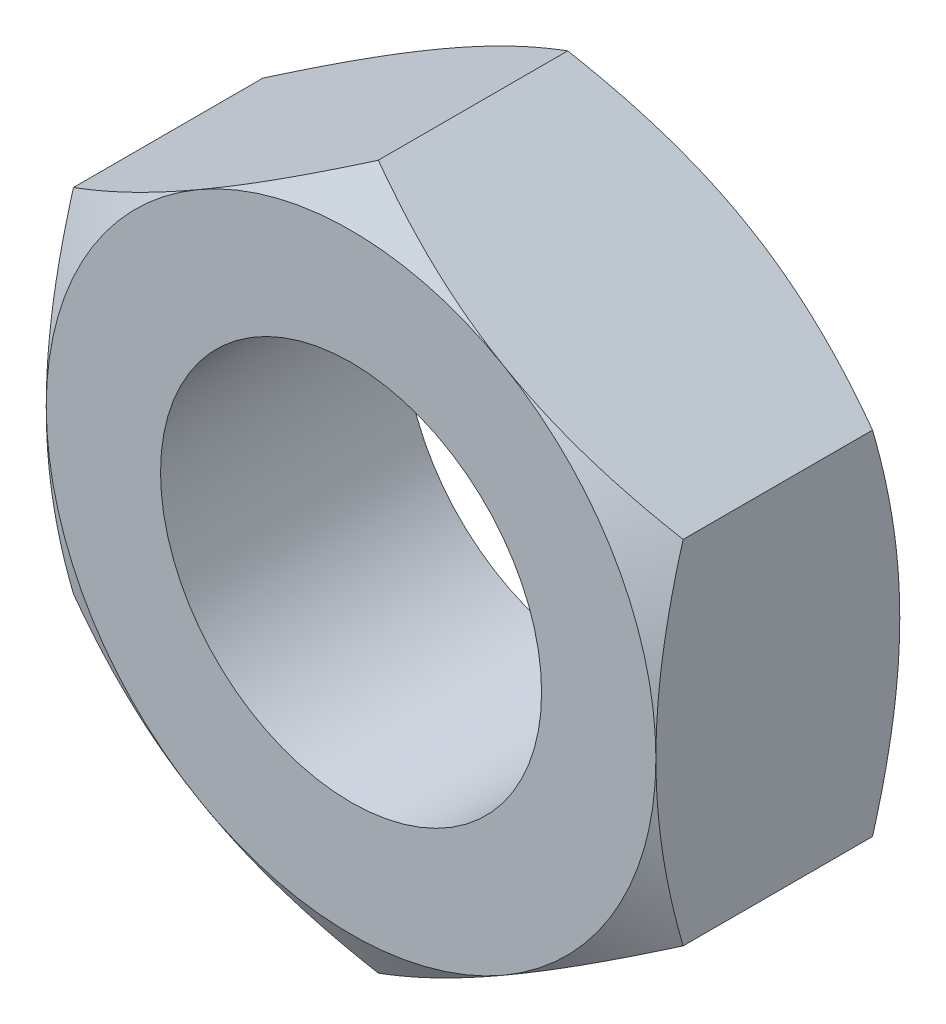
ISO-10303-21;
HEADER;
FILE_DESCRIPTION(('STEP AP214'),'2;1');
FILE_NAME('part.step','',(''),(''),'','','');
FILE_SCHEMA(('AUTOMOTIVE_DESIGN { 1 0 10303 214 1 1 1 1 }'));
ENDSEC;
DATA;
#1=APPLICATION_CONTEXT('core data for automotive mechanical design processes');
#2=APPLICATION_PROTOCOL_DEFINITION('international standard','automotive_design',2000,#1);
#3=PRODUCT_CONTEXT('',#1,'mechanical');
#4=PRODUCT('Part','Part','',(#3));
#5=PRODUCT_RELATED_PRODUCT_CATEGORY('part','',(#4));
#6=PRODUCT_DEFINITION_FORMATION('','',#4);
#7=PRODUCT_DEFINITION_CONTEXT('part definition',#1,'design');
#8=PRODUCT_DEFINITION('design','',#6,#7);
#9=PRODUCT_DEFINITION_SHAPE('','',#8);
#10=(LENGTH_UNIT() NAMED_UNIT(*) SI_UNIT(.MILLI.,.METRE.));
#11=(NAMED_UNIT(*) PLANE_ANGLE_UNIT() SI_UNIT($,.RADIAN.));
#12=(NAMED_UNIT(*) SI_UNIT($,.STERADIAN.) SOLID_ANGLE_UNIT());
#13=UNCERTAINTY_MEASURE_WITH_UNIT(LENGTH_MEASURE(1.E-05),#10,'distance_accuracy_value','');
#14=(GEOMETRIC_REPRESENTATION_CONTEXT(3) GLOBAL_UNCERTAINTY_ASSIGNED_CONTEXT((#13)) GLOBAL_UNIT_ASSIGNED_CONTEXT((#10,
#11,#12)) REPRESENTATION_CONTEXT('',''));
#15=CARTESIAN_POINT('',(0.,0.,0.));
#16=DIRECTION('',(0.,0.,1.));
#17=DIRECTION('',(1.,0.,0.));
#18=AXIS2_PLACEMENT_3D('',#15,#16,#17);
#19=CARTESIAN_POINT('',(3.99999999999999,2.30940107675854,3.19999999999999));
#20=DIRECTION('',(-0.499999999999998,-0.866025403784441,0.));
#21=DIRECTION('',(0.866025403784441,-0.499999999999998,0.));
#22=AXIS2_PLACEMENT_3D('',#19,#20,#21);
#23=PLANE('',#22);
#24=DIRECTION('',(0.,0.,-1.));
#25=VECTOR('',#24,1.);
#26=CARTESIAN_POINT('',(3.99999999999999,2.30940107675854,3.19999999999999));
#27=LINE('',#26,#25);
#28=CARTESIAN_POINT('',(3.99999999999999,2.30940107675855,2.84273441009183));
#29=VERTEX_POINT('',#28);
#30=CARTESIAN_POINT('',(3.99999999999999,2.30940107675854,0.357265589908158));
#31=VERTEX_POINT('',#30);
#32=EDGE_CURVE('E276',#29,#31,#27,.T.);
#33=ORIENTED_EDGE('',*,*,#32,.T.);
#34=CARTESIAN_POINT('',(4.00019999999999,2.30928560670471,0.357332259074762));
#35=CARTESIAN_POINT('',(3.82442084967676,2.41077174646174,0.298717873648283));
#36=CARTESIAN_POINT('',(3.6471243836736,2.51313390883503,0.245410321462265));
#37=CARTESIAN_POINT('',(3.28946140682428,2.71963072479815,0.152361670746409));
#38=CARTESIAN_POINT('',(3.10908854102983,2.82376904741908,0.11265348902971));
#39=CARTESIAN_POINT('',(2.75057818129719,3.03075510011799,0.0508422152802874));
#40=CARTESIAN_POINT('',(2.57249584706484,3.13357098372495,0.0283277315228994));
#41=CARTESIAN_POINT('',(2.21549328283347,3.33968651028532,0.0014506231465906));
#42=CARTESIAN_POINT('',(2.03657435035588,3.44298540411437,-0.00293425857305206));
#43=CARTESIAN_POINT('',(1.70225715780325,3.63600352522935,0.00619007293997645));
#44=CARTESIAN_POINT('',(1.54680884001292,3.72575165335068,0.0174589539880046));
#45=CARTESIAN_POINT('',(1.23692494436493,3.90466320392057,0.0531739907982059));
#46=CARTESIAN_POINT('',(1.08249043825586,3.99382600759481,0.0776323457115441));
#47=CARTESIAN_POINT('',(0.771967672225416,4.17310641015199,0.138776064919299));
#48=CARTESIAN_POINT('',(0.615918711936894,4.26320131938133,0.175720603654873));
#49=CARTESIAN_POINT('',(0.30614816459616,4.44204742827552,0.259570072548033));
#50=CARTESIAN_POINT('',(0.152422609226221,4.53080091904968,0.306455302212743));
#51=CARTESIAN_POINT('',(-0.00019999999999968,4.61891762357086,0.357332259074762));
#52=B_SPLINE_CURVE_WITH_KNOTS('',3,(#34,#35,#36,#37,#38,#39,#40,#41,#42,#43,#44,#45,#46,#47,#48,
#49,#50,#51),.UNSPECIFIED.,.F.,.F.,(4,2,2,2,2,2,2,2,4),(0.,0.634047835695965,1.26961969224543,
1.88946157213122,2.50854226669297,3.04757825393385,3.58711366126902,4.13861653143761,
4.6890364803774),.UNSPECIFIED.);
#53=CARTESIAN_POINT('',(1.99999999999999,3.46410161513776,0.));
#54=VERTEX_POINT('',#53);
#55=EDGE_CURVE('E318',#31,#54,#52,.T.);
#56=ORIENTED_EDGE('',*,*,#55,.T.);
#57=CARTESIAN_POINT('',(0.,4.61880215351702,0.357265589908158));
#58=VERTEX_POINT('',#57);
#59=EDGE_CURVE('E320',#54,#58,#52,.T.);
#60=ORIENTED_EDGE('',*,*,#59,.T.);
#61=DIRECTION('',(0.,0.,-1.));
#62=VECTOR('',#61,1.);
#63=CARTESIAN_POINT('',(0.,4.61880215351702,3.19999999999999));
#64=LINE('',#63,#62);
#65=CARTESIAN_POINT('',(0.,4.61880215351702,2.84273441009183));
#66=VERTEX_POINT('',#65);
#67=EDGE_CURVE('E288',#66,#58,#64,.T.);
#68=ORIENTED_EDGE('',*,*,#67,.F.);
#69=CARTESIAN_POINT('',(-0.000200000000001414,4.61891762357086,2.84266774092523));
#70=CARTESIAN_POINT('',(0.175579150323229,4.51743148381382,2.9012821263517));
#71=CARTESIAN_POINT('',(0.352875616326382,4.41506932144053,2.95458967853772));
#72=CARTESIAN_POINT('',(0.71053859317571,4.20857250547741,3.04763832925358));
#73=CARTESIAN_POINT('',(0.890911458970156,4.10443418285648,3.08734651097028));
#74=CARTESIAN_POINT('',(1.2494218187028,3.89744813015757,3.1491577847197));
#75=CARTESIAN_POINT('',(1.42750415293515,3.79463224655061,3.17167226847709));
#76=CARTESIAN_POINT('',(1.78450671716652,3.58851671999024,3.1985493768534));
#77=CARTESIAN_POINT('',(1.96342564964411,3.48521782616118,3.20293425857305));
#78=CARTESIAN_POINT('',(2.29774284219674,3.29219970504621,3.19380992706002));
#79=CARTESIAN_POINT('',(2.45319115998707,3.20245157692489,3.18254104601199));
#80=CARTESIAN_POINT('',(2.76307505563505,3.02354002635499,3.14682600920178));
#81=CARTESIAN_POINT('',(2.91750956174413,2.93437722268075,3.12236765428845));
#82=CARTESIAN_POINT('',(3.22803232777457,2.75509682012357,3.06122393508069));
#83=CARTESIAN_POINT('',(3.38408128806309,2.66500191089423,3.02427939634512));
#84=CARTESIAN_POINT('',(3.69385183540383,2.48615580200004,2.94042992745196));
#85=CARTESIAN_POINT('',(3.84757739077377,2.39740231122589,2.89354469778725));
#86=CARTESIAN_POINT('',(4.00019999999999,2.30928560670471,2.84266774092523));
#87=B_SPLINE_CURVE_WITH_KNOTS('',3,(#69,#70,#71,#72,#73,#74,#75,#76,#77,#78,#79,#80,#81,#82,#83,
#84,#85,#86),.UNSPECIFIED.,.F.,.F.,(4,2,2,2,2,2,2,2,4),(0.,0.634047835695966,1.26961969224544,
1.88946157213123,2.50854226669298,3.04757825393385,3.58711366126902,4.13861653143762,
4.6890364803774),.UNSPECIFIED.);
#88=CARTESIAN_POINT('',(1.99999999999999,3.46410161513776,3.19999999999999));
#89=VERTEX_POINT('',#88);
#90=EDGE_CURVE('E258',#66,#89,#87,.T.);
#91=ORIENTED_EDGE('',*,*,#90,.T.);
#92=EDGE_CURVE('E240',#89,#29,#87,.T.);
#93=ORIENTED_EDGE('',*,*,#92,.T.);
#94=EDGE_LOOP('',(#33,#56,#60,#68,#91,#93));
#95=FACE_BOUND('',#94,.T.);
#96=ADVANCED_FACE('F39',(#95),#23,.F.);
#97=CARTESIAN_POINT('',(0.,4.61880215351702,3.19999999999999));
#98=DIRECTION('',(0.500000000000003,-0.866025403784439,0.));
#99=DIRECTION('',(0.866025403784438,0.500000000000003,0.));
#100=AXIS2_PLACEMENT_3D('',#97,#98,#99);
#101=PLANE('',#100);
#102=ORIENTED_EDGE('',*,*,#67,.T.);
#103=CARTESIAN_POINT('',(0.000200000000001414,4.61891762357086,0.357332259074762));
#104=CARTESIAN_POINT('',(-0.175579150323226,4.51743148381382,0.298717873648284));
#105=CARTESIAN_POINT('',(-0.352875616326379,4.41506932144053,0.245410321462266));
#106=CARTESIAN_POINT('',(-0.710538593175705,4.2085725054774,0.152361670746408));
#107=CARTESIAN_POINT('',(-0.89091145897015,4.10443418285648,0.112653489029707));
#108=CARTESIAN_POINT('',(-1.24942181870279,3.89744813015757,0.0508422152802819));
#109=CARTESIAN_POINT('',(-1.42750415293514,3.7946322465506,0.0283277315228924));
#110=CARTESIAN_POINT('',(-1.78450671716651,3.58851671999023,0.00145062314658245));
#111=CARTESIAN_POINT('',(-1.9634256496441,3.48521782616117,-0.00293425857305977));
#112=CARTESIAN_POINT('',(-2.29774284219673,3.29219970504619,0.00619007293996701));
#113=CARTESIAN_POINT('',(-2.45319115998707,3.20245157692487,0.0174589539879935));
#114=CARTESIAN_POINT('',(-2.76307505563506,3.02354002635497,0.0531739907981941));
#115=CARTESIAN_POINT('',(-2.91750956174414,2.93437722268072,0.077632345711533));
#116=CARTESIAN_POINT('',(-3.22803232777459,2.75509682012354,0.138776064919289));
#117=CARTESIAN_POINT('',(-3.38408128806311,2.66500191089419,0.175720603654863));
#118=CARTESIAN_POINT('',(-3.69385183540385,2.486155802,0.259570072548026));
#119=CARTESIAN_POINT('',(-3.84757739077379,2.39740231122584,0.306455302212738));
#120=CARTESIAN_POINT('',(-4.00020000000002,2.30928560670466,0.357332259074762));
#121=B_SPLINE_CURVE_WITH_KNOTS('',3,(#103,#104,#105,#106,#107,#108,#109,#110,#111,#112,#113,
#114,#115,#116,#117,#118,#119,#120),.UNSPECIFIED.,.F.,.F.,(4,2,2,2,2,2,2,2,4),(0.,
0.634047835695967,1.26961969224544,1.88946157213123,2.50854226669298,3.04757825393387,
3.58711366126905,4.13861653143765,4.68903648037745),.UNSPECIFIED.);
#122=CARTESIAN_POINT('',(-2.00000000000001,3.46410161513776,0.));
#123=VERTEX_POINT('',#122);
#124=EDGE_CURVE('E161',#58,#123,#121,.T.);
#125=ORIENTED_EDGE('',*,*,#124,.T.);
#126=CARTESIAN_POINT('',(-4.00000000000002,2.3094010767585,0.357265589908158));
#127=VERTEX_POINT('',#126);
#128=EDGE_CURVE('E147',#123,#127,#121,.T.);
#129=ORIENTED_EDGE('',*,*,#128,.T.);
#130=DIRECTION('',(0.,0.,-1.));
#131=VECTOR('',#130,1.);
#132=CARTESIAN_POINT('',(-4.00000000000002,2.3094010767585,3.19999999999999));
#133=LINE('',#132,#131);
#134=CARTESIAN_POINT('',(-4.00000000000002,2.3094010767585,2.84273441009183));
#135=VERTEX_POINT('',#134);
#136=EDGE_CURVE('E160',#135,#127,#133,.T.);
#137=ORIENTED_EDGE('',*,*,#136,.F.);
#138=CARTESIAN_POINT('',(-4.00020000000002,2.30928560670466,2.84266774092523));
#139=CARTESIAN_POINT('',(-3.82442084967679,2.4107717464617,2.90128212635171));
#140=CARTESIAN_POINT('',(-3.64712438367363,2.51313390883499,2.95458967853773));
#141=CARTESIAN_POINT('',(-3.28946140682431,2.71963072479811,3.04763832925358));
#142=CARTESIAN_POINT('',(-3.10908854102986,2.82376904741904,3.08734651097028));
#143=CARTESIAN_POINT('',(-2.75057818129722,3.03075510011795,3.14915778471971));
#144=CARTESIAN_POINT('',(-2.57249584706487,3.13357098372491,3.1716722684771));
#145=CARTESIAN_POINT('',(-2.2154932828335,3.33968651028528,3.19854937685341));
#146=CARTESIAN_POINT('',(-2.03657435035591,3.44298540411434,3.20293425857305));
#147=CARTESIAN_POINT('',(-1.70225715780328,3.63600352522932,3.19380992706003));
#148=CARTESIAN_POINT('',(-1.54680884001295,3.72575165335065,3.182541046012));
#149=CARTESIAN_POINT('',(-1.23692494436495,3.90466320392054,3.14682600920179));
#150=CARTESIAN_POINT('',(-1.08249043825588,3.99382600759479,3.12236765428845));
#151=CARTESIAN_POINT('',(-0.771967672225427,4.17310641015198,3.0612239350807));
#152=CARTESIAN_POINT('',(-0.615918711936902,4.26320131938132,3.02427939634512));
#153=CARTESIAN_POINT('',(-0.306148164596162,4.44204742827551,2.94042992745196));
#154=CARTESIAN_POINT('',(-0.152422609226221,4.53080091904967,2.89354469778725));
#155=CARTESIAN_POINT('',(0.000200000000000547,4.61891762357086,2.84266774092523));
#156=B_SPLINE_CURVE_WITH_KNOTS('',3,(#138,#139,#140,#141,#142,#143,#144,#145,#146,#147,#148,
#149,#150,#151,#152,#153,#154,#155),.UNSPECIFIED.,.F.,.F.,(4,2,2,2,2,2,2,2,4),(0.,
0.634047835695965,1.26961969224543,1.88946157213122,2.50854226669297,3.04757825393386,
3.58711366126904,4.13861653143765,4.68903648037745),.UNSPECIFIED.);
#157=CARTESIAN_POINT('',(-2.00000000000001,3.46410161513776,3.19999999999999));
#158=VERTEX_POINT('',#157);
#159=EDGE_CURVE('E256',#135,#158,#156,.T.);
#160=ORIENTED_EDGE('',*,*,#159,.T.);
#161=EDGE_CURVE('E202',#158,#66,#156,.T.);
#162=ORIENTED_EDGE('',*,*,#161,.T.);
#163=EDGE_LOOP('',(#102,#125,#129,#137,#160,#162));
#164=FACE_BOUND('',#163,.T.);
#165=ADVANCED_FACE('F187',(#164),#101,.F.);
#166=CARTESIAN_POINT('',(-4.00000000000002,2.3094010767585,3.19999999999999));
#167=DIRECTION('',(1.,0.,0.));
#168=DIRECTION('',(0.,1.,0.));
#169=AXIS2_PLACEMENT_3D('',#166,#167,#168);
#170=PLANE('',#169);
#171=ORIENTED_EDGE('',*,*,#136,.T.);
#172=CARTESIAN_POINT('',(-3.99999999999999,-6.20531485108539,1.95306817635055));
#173=CARTESIAN_POINT('',(-3.99999999999999,-6.03059559937679,1.86830570973528));
#174=CARTESIAN_POINT('',(-3.99999999999999,-5.85547548724872,1.78435539020549));
#175=CARTESIAN_POINT('',(-3.99999999999999,-5.50422038479375,1.61853575731478));
#176=CARTESIAN_POINT('',(-3.99999999999999,-5.32808524001501,1.53666677149536));
#177=CARTESIAN_POINT('',(-3.99999999999999,-4.97368033342963,1.37505504782418));
#178=CARTESIAN_POINT('',(-3.99999999999999,-4.79540417208425,1.29532629535012));
#179=CARTESIAN_POINT('',(-3.99999999999999,-4.43743463928703,1.1391287777984));
#180=CARTESIAN_POINT('',(-3.99999999999999,-4.25774133520144,1.06265985885286));
#181=CARTESIAN_POINT('',(-4.,-3.89083616292435,0.911445742892711));
#182=CARTESIAN_POINT('',(-4.,-3.70356846749713,0.836835265740932));
#183=CARTESIAN_POINT('',(-4.,-3.32684283238657,0.693256330654623));
#184=CARTESIAN_POINT('',(-4.,-3.13738464969201,0.624288505701615));
#185=CARTESIAN_POINT('',(-4.,-2.75633068535704,0.493803981419094));
#186=CARTESIAN_POINT('',(-4.,-2.56474011576776,0.432272214115611));
#187=CARTESIAN_POINT('',(-4.,-2.17881058178464,0.318633048569077));
#188=CARTESIAN_POINT('',(-3.99999999999999,-1.98447250332775,0.266522683888706));
#189=CARTESIAN_POINT('',(-4.,-1.59402130057405,0.174504423638667));
#190=CARTESIAN_POINT('',(-4.,-1.39792414052078,0.134530035778608));
#191=CARTESIAN_POINT('',(-4.00000000000001,-1.00328885929075,0.0690401121401172));
#192=CARTESIAN_POINT('',(-4.00000000000001,-0.804750970758018,0.0435232090625291));
#193=CARTESIAN_POINT('',(-4.00000000000001,-0.408819788571312,0.00931767853150848));
#194=CARTESIAN_POINT('',(-4.00000000000001,-0.211445666839738,0.000412601565093382));
#195=CARTESIAN_POINT('',(-4.00000000000001,0.183352945022197,-0.000384123780465341));
#196=CARTESIAN_POINT('',(-4.,0.380777435994328,0.00772453372664156));
#197=CARTESIAN_POINT('',(-4.,0.715890256509153,0.0353550938388946));
#198=CARTESIAN_POINT('',(-4.00000000000001,0.853936847968405,0.0507808323543803));
#199=CARTESIAN_POINT('',(-4.00000000000001,1.1290147152421,0.0889916223152015));
#200=CARTESIAN_POINT('',(-4.00000000000001,1.26604585060678,0.111777673039042));
#201=CARTESIAN_POINT('',(-4.00000000000001,1.6754368247132,0.189978189175679));
#202=CARTESIAN_POINT('',(-4.00000000000001,1.9459400294709,0.255220619350999));
#203=CARTESIAN_POINT('',(-4.00000000000002,2.35040662161547,0.368289136118621));
#204=CARTESIAN_POINT('',(-4.00000000000002,2.48646841753158,0.409035848563481));
#205=CARTESIAN_POINT('',(-4.00000000000002,2.75727018628109,0.494745769578396));
#206=CARTESIAN_POINT('',(-4.00000000000002,2.89201015046039,0.539709005733919));
#207=CARTESIAN_POINT('',(-4.00000000000002,3.16021113460967,0.633131741469656));
#208=CARTESIAN_POINT('',(-4.00000000000002,3.2936725638897,0.681590076661986));
#209=CARTESIAN_POINT('',(-4.00000000000002,3.55949084336818,0.781434487894111));
#210=CARTESIAN_POINT('',(-4.00000000000002,3.6918477058562,0.83282053130991));
#211=CARTESIAN_POINT('',(-4.00000000000002,4.00148018311937,0.956345831773722));
#212=CARTESIAN_POINT('',(-4.00000000000002,4.17835670511997,1.02948355605103));
#213=CARTESIAN_POINT('',(-4.00000000000002,4.53062333479865,1.17926468904874));
#214=CARTESIAN_POINT('',(-4.00000000000002,4.70601335572145,1.25590830073272));
#215=CARTESIAN_POINT('',(-4.00000000000002,5.05557707577674,1.41200457299534));
#216=CARTESIAN_POINT('',(-4.00000000000002,5.22975052860242,1.49145778373291));
#217=CARTESIAN_POINT('',(-4.00000000000002,5.57705164417118,1.65262125473595));
#218=CARTESIAN_POINT('',(-4.00000000000002,5.75017928482936,1.73433156246389));
#219=CARTESIAN_POINT('',(-4.00000000000003,6.2685872261397,1.98235594218953));
#220=CARTESIAN_POINT('',(-4.00000000000003,6.61255544761498,2.15141085262719));
#221=CARTESIAN_POINT('',(-4.00000000000003,7.29800744765992,2.49448270875328));
#222=CARTESIAN_POINT('',(-4.00000000000003,7.63949113521785,2.66849983507696));
#223=CARTESIAN_POINT('',(-4.00000000000003,8.29245240972907,3.00552170059946));
#224=CARTESIAN_POINT('',(-4.00000000000003,8.60407487946716,3.16824626182502));
#225=CARTESIAN_POINT('',(-4.00000000000004,9.22615276047956,3.49593313052514));
#226=CARTESIAN_POINT('',(-4.00000000000004,9.53660813128945,3.66089551468979));
#227=CARTESIAN_POINT('',(-4.00000000000004,10.1558450303186,3.99212251260688));
#228=CARTESIAN_POINT('',(-4.00000000000004,10.4646287956752,4.15838294941037));
#229=CARTESIAN_POINT('',(-4.00000000000004,11.0814482833042,4.49224640286864));
#230=CARTESIAN_POINT('',(-4.00000000000004,11.3894840453237,4.65984934605702));
#231=CARTESIAN_POINT('',(-4.00000000000004,11.697243761791,4.82795398009453));
#232=B_SPLINE_CURVE_WITH_KNOTS('',3,(#172,#173,#174,#175,#176,#177,#178,#179,#180,#181,#182,
#183,#184,#185,#186,#187,#188,#189,#190,#191,#192,#193,#194,#195,#196,#197,#198,#199,#200,#201,
#202,#203,#204,#205,#206,#207,#208,#209,#210,#211,#212,#213,#214,#215,#216,#217,#218,#219,#220,
#221,#222,#223,#224,#225,#226,#227,#228,#229,#230,#231),.UNSPECIFIED.,.F.,.F.,(4,2,2,2,2,2,2,2,
2,2,2,2,2,2,2,2,2,2,2,2,2,2,2,2,2,2,2,2,2,4),(0.,0.582590522715544,1.16527216773886,
1.75112278792907,2.3369457246093,2.941625989466,3.54637399341449,4.14987526068661,
4.75318617643643,5.35312931718923,5.95301570956946,6.54502955530821,7.13705404482698,
7.55356931022439,7.97014114792471,8.8037473346155,9.22980760087719,9.65587065471752,
10.0817924160395,10.5077094321643,11.0818624696283,11.6560487882508,12.2303481700782,
12.8046596375426,13.9543924249202,15.1041671185873,16.1588070157011,17.2134831470422,
18.2655771711968,19.3176140093336),.UNSPECIFIED.);
#233=CARTESIAN_POINT('',(-4.,0.,0.));
#234=VERTEX_POINT('',#233);
#235=EDGE_CURVE('E139',#127,#234,#232,.F.);
#236=ORIENTED_EDGE('',*,*,#235,.T.);
#237=CARTESIAN_POINT('',(-4.,-2.30940107675852,0.357265589908161));
#238=VERTEX_POINT('',#237);
#239=EDGE_CURVE('E128',#234,#238,#232,.F.);
#240=ORIENTED_EDGE('',*,*,#239,.T.);
#241=DIRECTION('',(0.,0.,-1.));
#242=VECTOR('',#241,1.);
#243=CARTESIAN_POINT('',(-4.,-2.30940107675852,3.2));
#244=LINE('',#243,#242);
#245=CARTESIAN_POINT('',(-4.,-2.30940107675852,2.84273441009184));
#246=VERTEX_POINT('',#245);
#247=EDGE_CURVE('E270',#246,#238,#244,.T.);
#248=ORIENTED_EDGE('',*,*,#247,.F.);
#249=CARTESIAN_POINT('',(-3.99999999999999,-6.20531485108539,1.24693182364945));
#250=CARTESIAN_POINT('',(-3.99999999999999,-6.03059559937679,1.33169429026471));
#251=CARTESIAN_POINT('',(-3.99999999999999,-5.85547548724872,1.4156446097945));
#252=CARTESIAN_POINT('',(-3.99999999999999,-5.50422038479375,1.58146424268521));
#253=CARTESIAN_POINT('',(-3.99999999999999,-5.32808524001501,1.66333322850463));
#254=CARTESIAN_POINT('',(-3.99999999999999,-4.97368033342963,1.82494495217581));
#255=CARTESIAN_POINT('',(-3.99999999999999,-4.79540417208425,1.90467370464987));
#256=CARTESIAN_POINT('',(-3.99999999999999,-4.43743463928703,2.06087122220158));
#257=CARTESIAN_POINT('',(-3.99999999999999,-4.25774133520145,2.13734014114713));
#258=CARTESIAN_POINT('',(-4.,-3.89083616292436,2.28855425710728));
#259=CARTESIAN_POINT('',(-4.,-3.70356846749713,2.36316473425906));
#260=CARTESIAN_POINT('',(-4.,-3.32684283238657,2.50674366934537));
#261=CARTESIAN_POINT('',(-4.,-3.13738464969201,2.57571149429837));
#262=CARTESIAN_POINT('',(-4.,-2.75633068535704,2.70619601858089));
#263=CARTESIAN_POINT('',(-4.,-2.56474011576776,2.76772778588438));
#264=CARTESIAN_POINT('',(-4.,-2.17881058178464,2.88136695143091));
#265=CARTESIAN_POINT('',(-4.,-1.98447250332775,2.93347731611129));
#266=CARTESIAN_POINT('',(-4.,-1.59402130057405,3.02549557636133));
#267=CARTESIAN_POINT('',(-4.,-1.39792414052078,3.06546996422138));
#268=CARTESIAN_POINT('',(-4.00000000000001,-1.00328885929075,3.13095988785987));
#269=CARTESIAN_POINT('',(-4.00000000000001,-0.804750970758019,3.15647679093746));
#270=CARTESIAN_POINT('',(-4.00000000000001,-0.408819788571313,3.19068232146848));
#271=CARTESIAN_POINT('',(-4.00000000000001,-0.211445666839739,3.19958739843489));
#272=CARTESIAN_POINT('',(-4.00000000000001,0.183352945022196,3.20038412378046));
#273=CARTESIAN_POINT('',(-4.00000000000001,0.380777435994327,3.19227546627336));
#274=CARTESIAN_POINT('',(-4.00000000000001,0.715890256509151,3.16464490616111));
#275=CARTESIAN_POINT('',(-4.00000000000001,0.853936847968402,3.14921916764561));
#276=CARTESIAN_POINT('',(-4.00000000000001,1.12901471524209,3.11100837768478));
#277=CARTESIAN_POINT('',(-4.00000000000001,1.26604585060677,3.08822232696095));
#278=CARTESIAN_POINT('',(-4.00000000000001,1.6754368247132,3.01002181082431));
#279=CARTESIAN_POINT('',(-4.00000000000001,1.9459400294709,2.94477938064899));
#280=CARTESIAN_POINT('',(-4.00000000000002,2.35040662161546,2.83171086388137));
#281=CARTESIAN_POINT('',(-4.00000000000002,2.48646841753158,2.79096415143651));
#282=CARTESIAN_POINT('',(-4.00000000000002,2.75727018628109,2.70525423042159));
#283=CARTESIAN_POINT('',(-4.00000000000002,2.89201015046039,2.66029099426607));
#284=CARTESIAN_POINT('',(-4.00000000000002,3.16021113460967,2.56686825853033));
#285=CARTESIAN_POINT('',(-4.00000000000002,3.2936725638897,2.518409923338));
#286=CARTESIAN_POINT('',(-4.00000000000002,3.55949084336818,2.41856551210588));
#287=CARTESIAN_POINT('',(-4.00000000000002,3.6918477058562,2.36717946869008));
#288=CARTESIAN_POINT('',(-4.00000000000002,4.00148018311937,2.24365416822627));
#289=CARTESIAN_POINT('',(-4.00000000000002,4.17835670511997,2.17051644394896));
#290=CARTESIAN_POINT('',(-4.00000000000002,4.53062333479865,2.02073531095124));
#291=CARTESIAN_POINT('',(-4.00000000000002,4.70601335572144,1.94409169926727));
#292=CARTESIAN_POINT('',(-4.00000000000002,5.05557707577673,1.78799542700465));
#293=CARTESIAN_POINT('',(-4.00000000000002,5.22975052860242,1.70854221626708));
#294=CARTESIAN_POINT('',(-4.00000000000002,5.57705164417117,1.54737874526404));
#295=CARTESIAN_POINT('',(-4.00000000000002,5.75017928482935,1.4656684375361));
#296=CARTESIAN_POINT('',(-4.00000000000003,6.2685872261397,1.21764405781046));
#297=CARTESIAN_POINT('',(-4.00000000000003,6.61255544761497,1.0485891473728));
#298=CARTESIAN_POINT('',(-4.00000000000003,7.29800744765991,0.705517291246706));
#299=CARTESIAN_POINT('',(-4.00000000000003,7.63949113521784,0.531500164923033));
#300=CARTESIAN_POINT('',(-4.00000000000003,8.29245240972907,0.194478299400528));
#301=CARTESIAN_POINT('',(-4.00000000000003,8.60407487946715,0.0317537381749734));
#302=CARTESIAN_POINT('',(-4.00000000000004,9.22615276047956,-0.295933130525146));
#303=CARTESIAN_POINT('',(-4.00000000000004,9.53660813128945,-0.460895514689804));
#304=CARTESIAN_POINT('',(-4.00000000000004,10.1558450303186,-0.792122512606892));
#305=CARTESIAN_POINT('',(-4.00000000000004,10.4646287956752,-0.958382949410377));
#306=CARTESIAN_POINT('',(-4.00000000000004,11.0814482833042,-1.29224640286865));
#307=CARTESIAN_POINT('',(-4.00000000000004,11.3894840453237,-1.45984934605702));
#308=CARTESIAN_POINT('',(-4.00000000000004,11.697243761791,-1.62795398009453));
#309=B_SPLINE_CURVE_WITH_KNOTS('',3,(#249,#250,#251,#252,#253,#254,#255,#256,#257,#258,#259,
#260,#261,#262,#263,#264,#265,#266,#267,#268,#269,#270,#271,#272,#273,#274,#275,#276,#277,#278,
#279,#280,#281,#282,#283,#284,#285,#286,#287,#288,#289,#290,#291,#292,#293,#294,#295,#296,#297,
#298,#299,#300,#301,#302,#303,#304,#305,#306,#307,#308),.UNSPECIFIED.,.F.,.F.,(4,2,2,2,2,2,2,2,
2,2,2,2,2,2,2,2,2,2,2,2,2,2,2,2,2,2,2,2,2,4),(0.,0.582590522715541,1.16527216773885,
1.75112278792907,2.3369457246093,2.94162598946599,3.54637399341449,4.14987526068661,
4.75318617643642,5.35312931718922,5.95301570956946,6.5450295553082,7.13705404482698,
7.55356931022438,7.9701411479247,8.80374733461549,9.22980760087718,9.65587065471751,
10.0817924160395,10.5077094321643,11.0818624696283,11.6560487882508,12.2303481700782,
12.8046596375426,13.9543924249202,15.1041671185873,16.1588070157011,17.2134831470422,
18.2655771711968,19.3176140093336),.UNSPECIFIED.);
#310=CARTESIAN_POINT('',(-4.00000000000001,0.,3.19999999999999));
#311=VERTEX_POINT('',#310);
#312=EDGE_CURVE('E200',#246,#311,#309,.T.);
#313=ORIENTED_EDGE('',*,*,#312,.T.);
#314=EDGE_CURVE('E193',#311,#135,#309,.T.);
#315=ORIENTED_EDGE('',*,*,#314,.T.);
#316=EDGE_LOOP('',(#171,#236,#240,#248,#313,#315));
#317=FACE_BOUND('',#316,.T.);
#318=ADVANCED_FACE('F157',(#317),#170,.F.);
#319=CARTESIAN_POINT('',(-4.,-2.30940107675852,3.2));
#320=DIRECTION('',(0.499999999999998,0.866025403784441,0.));
#321=DIRECTION('',(-0.866025403784441,0.499999999999998,0.));
#322=AXIS2_PLACEMENT_3D('',#319,#320,#321);
#323=PLANE('',#322);
#324=ORIENTED_EDGE('',*,*,#247,.T.);
#325=CARTESIAN_POINT('',(-4.00019999999999,-2.30928560670467,0.357332259074765));
#326=CARTESIAN_POINT('',(-3.82442084967677,-2.41077174646172,0.298717873648282));
#327=CARTESIAN_POINT('',(-3.64712438367361,-2.51313390883501,0.245410321462263));
#328=CARTESIAN_POINT('',(-3.28946140682429,-2.71963072479813,0.152361670746405));
#329=CARTESIAN_POINT('',(-3.10908854102984,-2.82376904741905,0.112653489029705));
#330=CARTESIAN_POINT('',(-2.7505781812972,-3.03075510011796,0.0508422152802811));
#331=CARTESIAN_POINT('',(-2.57249584706485,-3.13357098372493,0.0283277315228919));
#332=CARTESIAN_POINT('',(-2.21549328283348,-3.33968651028529,0.00145062314658218));
#333=CARTESIAN_POINT('',(-2.03657435035589,-3.44298540411435,-0.00293425857306011));
#334=CARTESIAN_POINT('',(-1.70225715780326,-3.63600352522933,0.0061900729399673));
#335=CARTESIAN_POINT('',(-1.54680884001293,-3.72575165335065,0.0174589539879944));
#336=CARTESIAN_POINT('',(-1.23692494436494,-3.90466320392055,0.0531739907981954));
#337=CARTESIAN_POINT('',(-1.08249043825586,-3.99382600759479,0.0776323457115341));
#338=CARTESIAN_POINT('',(-0.771967672225411,-4.17310641015197,0.138776064919289));
#339=CARTESIAN_POINT('',(-0.615918711936887,-4.26320131938131,0.175720603654863));
#340=CARTESIAN_POINT('',(-0.306148164596148,-4.44204742827551,0.259570072548026));
#341=CARTESIAN_POINT('',(-0.152422609226207,-4.53080091904966,0.306455302212739));
#342=CARTESIAN_POINT('',(0.000200000000015292,-4.61891762357084,0.357332259074765));
#343=B_SPLINE_CURVE_WITH_KNOTS('',3,(#325,#326,#327,#328,#329,#330,#331,#332,#333,#334,#335,
#336,#337,#338,#339,#340,#341,#342),.UNSPECIFIED.,.F.,.F.,(4,2,2,2,2,2,2,2,4),(0.,
0.634047835695965,1.26961969224543,1.88946157213122,2.50854226669297,3.04757825393386,
3.58711366126903,4.13861653143764,4.68903648037743),.UNSPECIFIED.);
#344=CARTESIAN_POINT('',(-1.99999999999999,-3.46410161513776,0.));
#345=VERTEX_POINT('',#344);
#346=EDGE_CURVE('E134',#238,#345,#343,.T.);
#347=ORIENTED_EDGE('',*,*,#346,.T.);
#348=CARTESIAN_POINT('',(0.,-4.61880215351701,0.357265589908161));
#349=VERTEX_POINT('',#348);
#350=EDGE_CURVE('E55',#345,#349,#343,.T.);
#351=ORIENTED_EDGE('',*,*,#350,.T.);
#352=DIRECTION('',(0.,0.,-1.));
#353=VECTOR('',#352,1.);
#354=CARTESIAN_POINT('',(0.,-4.61880215351701,3.2));
#355=LINE('',#354,#353);
#356=CARTESIAN_POINT('',(0.,-4.61880215351701,2.84273441009185));
#357=VERTEX_POINT('',#356);
#358=EDGE_CURVE('E283',#357,#349,#355,.T.);
#359=ORIENTED_EDGE('',*,*,#358,.F.);
#360=CARTESIAN_POINT('',(0.000200000000015292,-4.61891762357085,2.84266774092525));
#361=CARTESIAN_POINT('',(-0.175579150323216,-4.51743148381381,2.90128212635172));
#362=CARTESIAN_POINT('',(-0.352875616326369,-4.41506932144052,2.95458967853773));
#363=CARTESIAN_POINT('',(-0.710538593175695,-4.2085725054774,3.04763832925358));
#364=CARTESIAN_POINT('',(-0.890911458970139,-4.10443418285647,3.08734651097028));
#365=CARTESIAN_POINT('',(-1.24942181870278,-3.89744813015757,3.14915778471971));
#366=CARTESIAN_POINT('',(-1.42750415293513,-3.7946322465506,3.1716722684771));
#367=CARTESIAN_POINT('',(-1.7845067171665,-3.58851671999024,3.19854937685341));
#368=CARTESIAN_POINT('',(-1.96342564964409,-3.48521782616118,3.20293425857306));
#369=CARTESIAN_POINT('',(-2.29774284219672,-3.2921997050462,3.19380992706003));
#370=CARTESIAN_POINT('',(-2.45319115998705,-3.20245157692488,3.182541046012));
#371=CARTESIAN_POINT('',(-2.76307505563504,-3.02354002635498,3.14682600920179));
#372=CARTESIAN_POINT('',(-2.91750956174412,-2.93437722268074,3.12236765428846));
#373=CARTESIAN_POINT('',(-3.22803232777457,-2.75509682012355,3.0612239350807));
#374=CARTESIAN_POINT('',(-3.38408128806309,-2.66500191089422,3.02427939634512));
#375=CARTESIAN_POINT('',(-3.69385183540383,-2.48615580200002,2.94042992745196));
#376=CARTESIAN_POINT('',(-3.84757739077377,-2.39740231122586,2.89354469778726));
#377=CARTESIAN_POINT('',(-4.00019999999999,-2.30928560670467,2.84266774092525));
#378=B_SPLINE_CURVE_WITH_KNOTS('',3,(#360,#361,#362,#363,#364,#365,#366,#367,#368,#369,#370,
#371,#372,#373,#374,#375,#376,#377),.UNSPECIFIED.,.F.,.F.,(4,2,2,2,2,2,2,2,4),(0.,
0.634047835695962,1.26961969224543,1.88946157213122,2.50854226669296,3.04757825393385,
3.58711366126903,4.13861653143763,4.68903648037742),.UNSPECIFIED.);
#379=CARTESIAN_POINT('',(-1.99999999999999,-3.46410161513777,3.2));
#380=VERTEX_POINT('',#379);
#381=EDGE_CURVE('E245',#357,#380,#378,.T.);
#382=ORIENTED_EDGE('',*,*,#381,.T.);
#383=EDGE_CURVE('E201',#380,#246,#378,.T.);
#384=ORIENTED_EDGE('',*,*,#383,.T.);
#385=EDGE_LOOP('',(#324,#347,#351,#359,#382,#384));
#386=FACE_BOUND('',#385,.T.);
#387=ADVANCED_FACE('F186',(#386),#323,.F.);
#388=CARTESIAN_POINT('',(0.,-4.61880215351701,3.2));
#389=DIRECTION('',(-0.500000000000003,0.866025403784438,0.));
#390=DIRECTION('',(-0.866025403784438,-0.500000000000003,0.));
#391=AXIS2_PLACEMENT_3D('',#388,#389,#390);
#392=PLANE('',#391);
#393=ORIENTED_EDGE('',*,*,#358,.T.);
#394=CARTESIAN_POINT('',(-0.000199999999984067,-4.61891762357085,0.357332259074765));
#395=CARTESIAN_POINT('',(0.175579150323245,-4.51743148381381,0.298717873648282));
#396=CARTESIAN_POINT('',(0.352875616326397,-4.41506932144052,0.245410321462263));
#397=CARTESIAN_POINT('',(0.710538593175721,-4.20857250547739,0.152361670746404));
#398=CARTESIAN_POINT('',(0.890911458970165,-4.10443418285647,0.112653489029704));
#399=CARTESIAN_POINT('',(1.2494218187028,-3.89744813015756,0.0508422152802805));
#400=CARTESIAN_POINT('',(1.42750415293516,-3.79463224655059,0.0283277315228917));
#401=CARTESIAN_POINT('',(1.78450671716652,-3.58851671999022,0.00145062314658221));
#402=CARTESIAN_POINT('',(1.96342564964411,-3.48521782616116,-0.00293425857306025));
#403=CARTESIAN_POINT('',(2.29774284219674,-3.29219970504618,0.00619007293996739));
#404=CARTESIAN_POINT('',(2.45319115998708,-3.20245157692486,0.0174589539879947));
#405=CARTESIAN_POINT('',(2.76307505563507,-3.02354002635496,0.0531739907981957));
#406=CARTESIAN_POINT('',(2.91750956174414,-2.93437722268072,0.0776323457115343));
#407=CARTESIAN_POINT('',(3.22803232777459,-2.75509682012353,0.138776064919289));
#408=CARTESIAN_POINT('',(3.38408128806311,-2.66500191089419,0.175720603654864));
#409=CARTESIAN_POINT('',(3.69385183540384,-2.486155802,0.259570072548024));
#410=CARTESIAN_POINT('',(3.84757739077378,-2.39740231122584,0.306455302212735));
#411=CARTESIAN_POINT('',(4.0002,-2.30928560670465,0.357332259074755));
#412=B_SPLINE_CURVE_WITH_KNOTS('',3,(#394,#395,#396,#397,#398,#399,#400,#401,#402,#403,#404,
#405,#406,#407,#408,#409,#410,#411),.UNSPECIFIED.,.F.,.F.,(4,2,2,2,2,2,2,2,4),(0.,
0.634047835695965,1.26961969224543,1.88946157213122,2.50854226669297,3.04757825393385,
3.58711366126903,4.13861653143763,4.68903648037742),.UNSPECIFIED.);
#413=CARTESIAN_POINT('',(2.00000000000002,-3.46410161513775,0.));
#414=VERTEX_POINT('',#413);
#415=EDGE_CURVE('E460',#349,#414,#412,.T.);
#416=ORIENTED_EDGE('',*,*,#415,.T.);
#417=CARTESIAN_POINT('',(4.,-2.30940107675911,0.357265589907734));
#418=VERTEX_POINT('',#417);
#419=EDGE_CURVE('E62',#414,#418,#412,.T.);
#420=ORIENTED_EDGE('',*,*,#419,.T.);
#421=DIRECTION('',(0.,0.,-1.));
#422=VECTOR('',#421,1.);
#423=CARTESIAN_POINT('',(4.,-2.3094010767585,3.19999999999999));
#424=LINE('',#423,#422);
#425=CARTESIAN_POINT('',(4.,-2.3094010767585,2.84273441009184));
#426=VERTEX_POINT('',#425);
#427=EDGE_CURVE('E280',#426,#418,#424,.T.);
#428=ORIENTED_EDGE('',*,*,#427,.F.);
#429=CARTESIAN_POINT('',(4.0002,-2.30928560670465,2.84266774092524));
#430=CARTESIAN_POINT('',(3.82442084967677,-2.4107717464617,2.90128212635171));
#431=CARTESIAN_POINT('',(3.64712438367362,-2.51313390883499,2.95458967853773));
#432=CARTESIAN_POINT('',(3.2894614068243,-2.71963072479811,3.04763832925359));
#433=CARTESIAN_POINT('',(3.10908854102985,-2.82376904741904,3.08734651097029));
#434=CARTESIAN_POINT('',(2.75057818129721,-3.03075510011795,3.14915778471971));
#435=CARTESIAN_POINT('',(2.57249584706486,-3.13357098372492,3.1716722684771));
#436=CARTESIAN_POINT('',(2.2154932828335,-3.33968651028528,3.19854937685341));
#437=CARTESIAN_POINT('',(2.03657435035591,-3.44298540411434,3.20293425857305));
#438=CARTESIAN_POINT('',(1.70225715780328,-3.63600352522932,3.19380992706002));
#439=CARTESIAN_POINT('',(1.54680884001294,-3.72575165335065,3.18254104601199));
#440=CARTESIAN_POINT('',(1.23692494436496,-3.90466320392054,3.14682600920179));
#441=CARTESIAN_POINT('',(1.08249043825588,-3.99382600759478,3.12236765428846));
#442=CARTESIAN_POINT('',(0.771967672225437,-4.17310641015197,3.0612239350807));
#443=CARTESIAN_POINT('',(0.615918711936914,-4.26320131938131,3.02427939634512));
#444=CARTESIAN_POINT('',(0.306148164596178,-4.4420474282755,2.94042992745197));
#445=CARTESIAN_POINT('',(0.152422609226238,-4.53080091904966,2.89354469778726));
#446=CARTESIAN_POINT('',(-0.000199999999984067,-4.61891762357085,2.84266774092525));
#447=B_SPLINE_CURVE_WITH_KNOTS('',3,(#429,#430,#431,#432,#433,#434,#435,#436,#437,#438,#439,
#440,#441,#442,#443,#444,#445,#446),.UNSPECIFIED.,.F.,.F.,(4,2,2,2,2,2,2,2,4),(0.,
0.634047835695963,1.26961969224543,1.88946157213122,2.50854226669296,3.04757825393385,
3.58711366126902,4.13861653143762,4.68903648037741),.UNSPECIFIED.);
#448=CARTESIAN_POINT('',(2.00000000000001,-3.46410161513775,3.19999999999999));
#449=VERTEX_POINT('',#448);
#450=EDGE_CURVE('E233',#426,#449,#447,.T.);
#451=ORIENTED_EDGE('',*,*,#450,.T.);
#452=EDGE_CURVE('E251',#449,#357,#447,.T.);
#453=ORIENTED_EDGE('',*,*,#452,.T.);
#454=EDGE_LOOP('',(#393,#416,#420,#428,#451,#453));
#455=FACE_BOUND('',#454,.T.);
#456=ADVANCED_FACE('F346',(#455),#392,.F.);
#457=CARTESIAN_POINT('',(4.,-2.3094010767585,3.19999999999999));
#458=DIRECTION('',(-1.,0.,0.));
#459=DIRECTION('',(0.,-1.,0.));
#460=AXIS2_PLACEMENT_3D('',#457,#458,#459);
#461=PLANE('',#460);
#462=ORIENTED_EDGE('',*,*,#427,.T.);
#463=CARTESIAN_POINT('',(4.00000000000001,-6.20531485094847,1.95306817628411));
#464=CARTESIAN_POINT('',(4.00000000000001,-6.03059559924447,1.86830570967162));
#465=CARTESIAN_POINT('',(4.00000000000001,-5.855475487121,1.78435539014461));
#466=CARTESIAN_POINT('',(4.00000000000001,-5.50422038467524,1.61853575725944));
#467=CARTESIAN_POINT('',(4.00000000000001,-5.32808523990112,1.53666677144279));
#468=CARTESIAN_POINT('',(4.00000000000001,-4.97368033332504,1.37505504777714));
#469=CARTESIAN_POINT('',(4.00000000000001,-4.79540417198435,1.29532629530585));
#470=CARTESIAN_POINT('',(4.00000000000001,-4.43743463919654,1.13912877775962));
#471=CARTESIAN_POINT('',(4.00000000000001,-4.25774133511568,1.06265985881679));
#472=CARTESIAN_POINT('',(4.,-3.89083616284839,0.911445742862155));
#473=CARTESIAN_POINT('',(4.,-3.70356846742624,0.83683526571316));
#474=CARTESIAN_POINT('',(4.,-3.32684283232591,0.693256330632266));
#475=CARTESIAN_POINT('',(4.,-3.13738464963651,0.62428850568189));
#476=CARTESIAN_POINT('',(4.,-2.75633068531195,0.493803981404379));
#477=CARTESIAN_POINT('',(4.,-2.56474011572793,0.432272214103276));
#478=CARTESIAN_POINT('',(4.,-2.17881058175546,0.318633048561094));
#479=CARTESIAN_POINT('',(4.,-1.98447250330398,0.266522683882694));
#480=CARTESIAN_POINT('',(4.,-1.59402130056389,0.174504423636646));
#481=CARTESIAN_POINT('',(4.,-1.39792414051887,0.134530035778447));
#482=CARTESIAN_POINT('',(4.,-1.00328885930554,0.069040112142409));
#483=CARTESIAN_POINT('',(4.,-0.804750970781251,0.0435232090654147));
#484=CARTESIAN_POINT('',(4.,-0.408819788611291,0.00931767853408561));
#485=CARTESIAN_POINT('',(4.,-0.211445666888016,0.000412601566795399));
#486=CARTESIAN_POINT('',(3.99999999999999,0.183352944957454,-0.000384123781952416));
#487=CARTESIAN_POINT('',(3.99999999999999,0.38077743592142,0.00772453372284002));
#488=CARTESIAN_POINT('',(3.99999999999999,0.715890256425906,0.0353550938304478));
#489=CARTESIAN_POINT('',(3.99999999999999,0.853936847882895,0.0507808323440849));
#490=CARTESIAN_POINT('',(3.99999999999999,1.12901471515216,0.0889916223011062));
#491=CARTESIAN_POINT('',(3.99999999999999,1.26604585051467,0.111777673022996));
#492=CARTESIAN_POINT('',(3.99999999999999,1.67543682461472,0.189978189153737));
#493=CARTESIAN_POINT('',(3.99999999999999,1.94594002936832,0.255220619325073));
#494=CARTESIAN_POINT('',(3.99999999999999,2.35040662150677,0.368289136086812));
#495=CARTESIAN_POINT('',(3.99999999999999,2.4864684174208,0.409035848529698));
#496=CARTESIAN_POINT('',(3.99999999999999,2.75727018616618,0.494745769540723));
#497=CARTESIAN_POINT('',(3.99999999999999,2.89201015034342,0.539709005694331));
#498=CARTESIAN_POINT('',(3.99999999999999,3.1602111344886,0.633131741426301));
#499=CARTESIAN_POINT('',(3.99999999999999,3.29367256376658,0.681590076616779));
#500=CARTESIAN_POINT('',(3.99999999999999,3.55949084324097,0.781434487845267));
#501=CARTESIAN_POINT('',(3.99999999999999,3.69184770572695,0.832820531259282));
#502=CARTESIAN_POINT('',(3.99999999999998,4.0014801829887,0.95634583172031));
#503=CARTESIAN_POINT('',(3.99999999999998,4.17835670498988,1.02948355599672));
#504=CARTESIAN_POINT('',(3.99999999999998,4.53062333466967,1.17926468899287));
#505=CARTESIAN_POINT('',(3.99999999999998,4.70601335559298,1.25590830067616));
#506=CARTESIAN_POINT('',(3.99999999999998,5.05557707564925,1.41200457293757));
#507=CARTESIAN_POINT('',(3.99999999999998,5.2297505284754,1.49145778367462));
#508=CARTESIAN_POINT('',(3.99999999999998,5.57705164404504,1.65262125467673));
#509=CARTESIAN_POINT('',(3.99999999999998,5.75017928470364,1.73433156240428));
#510=CARTESIAN_POINT('',(3.99999999999998,6.26858722601521,1.98235594212885));
#511=CARTESIAN_POINT('',(3.99999999999998,6.61255544749124,2.151410852566));
#512=CARTESIAN_POINT('',(3.99999999999998,7.29800744753758,2.49448270869129));
#513=CARTESIAN_POINT('',(3.99999999999998,7.63949113509617,2.66849983501467));
#514=CARTESIAN_POINT('',(3.99999999999997,8.29245240960813,3.00552170053653));
#515=CARTESIAN_POINT('',(3.99999999999997,8.60407487934632,3.16824626176172));
#516=CARTESIAN_POINT('',(3.99999999999997,9.22615276035889,3.49593313046118));
#517=CARTESIAN_POINT('',(3.99999999999997,9.53660813116884,3.66089551462555));
#518=CARTESIAN_POINT('',(3.99999999999997,10.155845030198,3.99212251254208));
#519=CARTESIAN_POINT('',(3.99999999999997,10.4646287955546,4.15838294934529));
#520=CARTESIAN_POINT('',(3.99999999999997,11.0814482831834,4.49224640280306));
#521=CARTESIAN_POINT('',(3.99999999999996,11.3894840452029,4.6598493459912));
#522=CARTESIAN_POINT('',(3.99999999999996,11.6972437616702,4.82795398002849));
#523=B_SPLINE_CURVE_WITH_KNOTS('',3,(#463,#464,#465,#466,#467,#468,#469,#470,#471,#472,#473,
#474,#475,#476,#477,#478,#479,#480,#481,#482,#483,#484,#485,#486,#487,#488,#489,#490,#491,#492,
#493,#494,#495,#496,#497,#498,#499,#500,#501,#502,#503,#504,#505,#506,#507,#508,#509,#510,#511,
#512,#513,#514,#515,#516,#517,#518,#519,#520,#521,#522),.UNSPECIFIED.,.F.,.F.,(4,2,2,2,2,2,2,2,
2,2,2,2,2,2,2,2,2,2,2,2,2,2,2,2,2,2,2,2,2,4),(0.,0.582590522699492,1.16527216770675,
1.75112278788074,2.33694572454474,2.9416259893842,3.54637399331545,4.14987526057039,
4.75318617630304,5.35312931703053,5.95301570938549,6.54502955509958,7.13705404459368,
7.55356930998372,7.97014114767668,8.80374733435271,9.22980760060672,9.65587065443937,
10.0817924157537,10.5077094318709,11.0818624693354,11.6560487879585,12.2303481697865,
12.8046596372516,13.9543924246305,15.1041671182989,16.1588070154125,17.2134831467534,
18.2655771709075,19.3176140090437),.UNSPECIFIED.);
#524=CARTESIAN_POINT('',(4.00000000000001,0.,0.));
#525=VERTEX_POINT('',#524);
#526=EDGE_CURVE('E333',#418,#525,#523,.T.);
#527=ORIENTED_EDGE('',*,*,#526,.T.);
#528=EDGE_CURVE('E151',#525,#31,#523,.T.);
#529=ORIENTED_EDGE('',*,*,#528,.T.);
#530=ORIENTED_EDGE('',*,*,#32,.F.);
#531=CARTESIAN_POINT('',(4.00000000000001,-6.20531485094847,1.24693182371587));
#532=CARTESIAN_POINT('',(4.00000000000001,-6.03059559924448,1.33169429032836));
#533=CARTESIAN_POINT('',(4.00000000000001,-5.85547548712101,1.41564460985538));
#534=CARTESIAN_POINT('',(4.00000000000001,-5.50422038467525,1.58146424274054));
#535=CARTESIAN_POINT('',(4.00000000000001,-5.32808523990113,1.6633332285572));
#536=CARTESIAN_POINT('',(4.00000000000001,-4.97368033332505,1.82494495222285));
#537=CARTESIAN_POINT('',(4.00000000000001,-4.79540417198436,1.90467370469414));
#538=CARTESIAN_POINT('',(4.00000000000001,-4.43743463919655,2.06087122224037));
#539=CARTESIAN_POINT('',(4.00000000000001,-4.25774133511569,2.13734014118319));
#540=CARTESIAN_POINT('',(4.,-3.89083616284839,2.28855425713783));
#541=CARTESIAN_POINT('',(4.00000000000001,-3.70356846742624,2.36316473428683));
#542=CARTESIAN_POINT('',(4.,-3.32684283232591,2.50674366936772));
#543=CARTESIAN_POINT('',(4.,-3.13738464963651,2.5757114943181));
#544=CARTESIAN_POINT('',(4.,-2.75633068531196,2.70619601859561));
#545=CARTESIAN_POINT('',(4.,-2.56474011572793,2.76772778589672));
#546=CARTESIAN_POINT('',(4.,-2.17881058175547,2.88136695143889));
#547=CARTESIAN_POINT('',(4.,-1.98447250330397,2.93347731611728));
#548=CARTESIAN_POINT('',(4.,-1.59402130056389,3.02549557636333));
#549=CARTESIAN_POINT('',(4.,-1.39792414051887,3.06546996422154));
#550=CARTESIAN_POINT('',(4.,-1.00328885930554,3.13095988785758));
#551=CARTESIAN_POINT('',(4.,-0.804750970781251,3.15647679093458));
#552=CARTESIAN_POINT('',(4.,-0.40881978861129,3.1906823214659));
#553=CARTESIAN_POINT('',(4.,-0.211445666888016,3.19958739843319));
#554=CARTESIAN_POINT('',(3.99999999999999,0.183352944957454,3.20038412378194));
#555=CARTESIAN_POINT('',(3.99999999999999,0.38077743592142,3.19227546627715));
#556=CARTESIAN_POINT('',(3.99999999999999,0.715890256425907,3.16464490616954));
#557=CARTESIAN_POINT('',(3.99999999999999,0.853936847882896,3.1492191676559));
#558=CARTESIAN_POINT('',(3.99999999999999,1.12901471515216,3.11100837769888));
#559=CARTESIAN_POINT('',(3.99999999999999,1.26604585051467,3.08822232697699));
#560=CARTESIAN_POINT('',(3.99999999999999,1.67543682461472,3.01002181084625));
#561=CARTESIAN_POINT('',(3.99999999999999,1.94594002936832,2.94477938067492));
#562=CARTESIAN_POINT('',(3.99999999999999,2.35040662150677,2.83171086391318));
#563=CARTESIAN_POINT('',(3.99999999999999,2.4864684174208,2.79096415147029));
#564=CARTESIAN_POINT('',(3.99999999999999,2.75727018616617,2.70525423045927));
#565=CARTESIAN_POINT('',(3.99999999999999,2.89201015034341,2.66029099430566));
#566=CARTESIAN_POINT('',(3.99999999999999,3.1602111344886,2.56686825857369));
#567=CARTESIAN_POINT('',(3.99999999999999,3.29367256376658,2.51840992338321));
#568=CARTESIAN_POINT('',(3.99999999999999,3.55949084324097,2.41856551215473));
#569=CARTESIAN_POINT('',(3.99999999999999,3.69184770572695,2.36717946874072));
#570=CARTESIAN_POINT('',(3.99999999999998,4.0014801829887,2.2436541682797));
#571=CARTESIAN_POINT('',(3.99999999999998,4.17835670498988,2.17051644400327));
#572=CARTESIAN_POINT('',(3.99999999999998,4.53062333466966,2.02073531100712));
#573=CARTESIAN_POINT('',(3.99999999999998,4.70601335559297,1.94409169932383));
#574=CARTESIAN_POINT('',(3.99999999999998,5.05557707564925,1.78799542706242));
#575=CARTESIAN_POINT('',(3.99999999999998,5.2297505284754,1.70854221632537));
#576=CARTESIAN_POINT('',(3.99999999999998,5.57705164404504,1.54737874532326));
#577=CARTESIAN_POINT('',(3.99999999999998,5.75017928470363,1.46566843759572));
#578=CARTESIAN_POINT('',(3.99999999999998,6.2685872260152,1.21764405787114));
#579=CARTESIAN_POINT('',(3.99999999999998,6.61255544749123,1.04858914743399));
#580=CARTESIAN_POINT('',(3.99999999999998,7.29800744753758,0.705517291308703));
#581=CARTESIAN_POINT('',(3.99999999999998,7.63949113509616,0.53150016498532));
#582=CARTESIAN_POINT('',(3.99999999999997,8.29245240960813,0.194478299463459));
#583=CARTESIAN_POINT('',(3.99999999999997,8.60407487934631,0.0317537382382716));
#584=CARTESIAN_POINT('',(3.99999999999997,9.22615276035888,-0.295933130461194));
#585=CARTESIAN_POINT('',(3.99999999999997,9.53660813116884,-0.460895514625564));
#586=CARTESIAN_POINT('',(3.99999999999997,10.155845030198,-0.792122512542093));
#587=CARTESIAN_POINT('',(3.99999999999997,10.4646287955546,-0.958382949345305));
#588=CARTESIAN_POINT('',(3.99999999999997,11.0814482831834,-1.29224640280307));
#589=CARTESIAN_POINT('',(3.99999999999996,11.3894840452029,-1.45984934599121));
#590=CARTESIAN_POINT('',(3.99999999999996,11.6972437616702,-1.62795398002849));
#591=B_SPLINE_CURVE_WITH_KNOTS('',3,(#531,#532,#533,#534,#535,#536,#537,#538,#539,#540,#541,
#542,#543,#544,#545,#546,#547,#548,#549,#550,#551,#552,#553,#554,#555,#556,#557,#558,#559,#560,
#561,#562,#563,#564,#565,#566,#567,#568,#569,#570,#571,#572,#573,#574,#575,#576,#577,#578,#579,
#580,#581,#582,#583,#584,#585,#586,#587,#588,#589,#590),.UNSPECIFIED.,.F.,.F.,(4,2,2,2,2,2,2,2,
2,2,2,2,2,2,2,2,2,2,2,2,2,2,2,2,2,2,2,2,2,4),(0.,0.582590522699494,1.16527216770675,
1.75112278788074,2.33694572454474,2.9416259893842,3.54637399331546,4.1498752605704,
4.75318617630304,5.35312931703054,5.9530157093855,6.54502955509958,7.13705404459369,
7.55356930998373,7.97014114767668,8.80374733435271,9.22980760060672,9.65587065443937,
10.0817924157537,10.5077094318709,11.0818624693354,11.6560487879585,12.2303481697865,
12.8046596372516,13.9543924246305,15.1041671182989,16.1588070154125,17.2134831467534,
18.2655771709075,19.3176140090437),.UNSPECIFIED.);
#592=CARTESIAN_POINT('',(4.00000000000001,0.,3.19999999999999));
#593=VERTEX_POINT('',#592);
#594=EDGE_CURVE('E312',#29,#593,#591,.F.);
#595=ORIENTED_EDGE('',*,*,#594,.T.);
#596=EDGE_CURVE('E223',#593,#426,#591,.F.);
#597=ORIENTED_EDGE('',*,*,#596,.T.);
#598=EDGE_LOOP('',(#462,#527,#529,#530,#595,#597));
#599=FACE_BOUND('',#598,.T.);
#600=ADVANCED_FACE('F313',(#599),#461,.F.);
#601=CARTESIAN_POINT('',(8.00000000000002,0.,3.19999999999999));
#602=DIRECTION('',(0.,0.,-1.));
#603=DIRECTION('',(-1.,0.,0.));
#604=AXIS2_PLACEMENT_3D('',#601,#602,#603);
#605=PLANE('',#604);
#606=CARTESIAN_POINT('',(0.,0.,3.19999999999999));
#607=DIRECTION('',(0.,0.,1.));
#608=DIRECTION('',(1.,0.,0.));
#609=AXIS2_PLACEMENT_3D('',#606,#607,#608);
#610=CIRCLE('',#609,2.5);
#611=CARTESIAN_POINT('',(2.5,0.,3.19999999999999));
#612=VERTEX_POINT('',#611);
#613=EDGE_CURVE('E271',#612,#612,#610,.T.);
#614=ORIENTED_EDGE('',*,*,#613,.F.);
#615=EDGE_LOOP('',(#614));
#616=FACE_BOUND('',#615,.T.);
#617=CARTESIAN_POINT('',(0.,0.,3.19999999999999));
#618=DIRECTION('',(0.,0.,-1.));
#619=DIRECTION('',(-1.,0.,0.));
#620=AXIS2_PLACEMENT_3D('',#617,#618,#619);
#621=CIRCLE('',#620,4.);
#622=EDGE_CURVE('E267',#311,#158,#621,.T.);
#623=ORIENTED_EDGE('',*,*,#622,.F.);
#624=CARTESIAN_POINT('',(0.,0.,3.19999999999999));
#625=DIRECTION('',(0.,0.,-1.));
#626=DIRECTION('',(-1.,0.,0.));
#627=AXIS2_PLACEMENT_3D('',#624,#625,#626);
#628=CIRCLE('',#627,4.);
#629=EDGE_CURVE('E290',#311,#380,#628,.F.);
#630=ORIENTED_EDGE('',*,*,#629,.T.);
#631=EDGE_CURVE('E292',#380,#449,#628,.F.);
#632=ORIENTED_EDGE('',*,*,#631,.T.);
#633=EDGE_CURVE('E296',#449,#593,#628,.F.);
#634=ORIENTED_EDGE('',*,*,#633,.T.);
#635=EDGE_CURVE('E297',#593,#89,#628,.F.);
#636=ORIENTED_EDGE('',*,*,#635,.T.);
#637=EDGE_CURVE('E289',#89,#158,#628,.F.);
#638=ORIENTED_EDGE('',*,*,#637,.T.);
#639=EDGE_LOOP('',(#623,#630,#632,#634,#636,#638));
#640=FACE_BOUND('',#639,.T.);
#641=ADVANCED_FACE('F305',(#616,#640),#605,.F.);
#642=CARTESIAN_POINT('',(8.00000000000001,0.,0.));
#643=DIRECTION('',(0.,0.,-1.));
#644=DIRECTION('',(-1.,0.,0.));
#645=AXIS2_PLACEMENT_3D('',#642,#643,#644);
#646=PLANE('',#645);
#647=CARTESIAN_POINT('',(0.,0.,0.));
#648=DIRECTION('',(0.,0.,-1.));
#649=DIRECTION('',(-1.,0.,0.));
#650=AXIS2_PLACEMENT_3D('',#647,#648,#649);
#651=CIRCLE('',#650,4.);
#652=EDGE_CURVE('E11',#234,#345,#651,.F.);
#653=ORIENTED_EDGE('',*,*,#652,.F.);
#654=CARTESIAN_POINT('',(0.,0.,0.));
#655=DIRECTION('',(0.,0.,-1.));
#656=DIRECTION('',(-1.,0.,0.));
#657=AXIS2_PLACEMENT_3D('',#654,#655,#656);
#658=CIRCLE('',#657,4.);
#659=EDGE_CURVE('E144',#234,#123,#658,.T.);
#660=ORIENTED_EDGE('',*,*,#659,.T.);
#661=EDGE_CURVE('E48',#54,#123,#651,.F.);
#662=ORIENTED_EDGE('',*,*,#661,.F.);
#663=EDGE_CURVE('E295',#525,#54,#651,.F.);
#664=ORIENTED_EDGE('',*,*,#663,.F.);
#665=EDGE_CURVE('E461',#414,#525,#651,.F.);
#666=ORIENTED_EDGE('',*,*,#665,.F.);
#667=EDGE_CURVE('E47',#345,#414,#651,.F.);
#668=ORIENTED_EDGE('',*,*,#667,.F.);
#669=EDGE_LOOP('',(#653,#660,#662,#664,#666,#668));
#670=FACE_BOUND('',#669,.T.);
#671=CARTESIAN_POINT('',(0.,0.,0.));
#672=DIRECTION('',(0.,0.,1.));
#673=DIRECTION('',(1.,0.,0.));
#674=AXIS2_PLACEMENT_3D('',#671,#672,#673);
#675=CIRCLE('',#674,2.5);
#676=CARTESIAN_POINT('',(2.5,0.,0.));
#677=VERTEX_POINT('',#676);
#678=EDGE_CURVE('E208',#677,#677,#675,.T.);
#679=ORIENTED_EDGE('',*,*,#678,.T.);
#680=EDGE_LOOP('',(#679));
#681=FACE_BOUND('',#680,.T.);
#682=ADVANCED_FACE('F153',(#670,#681),#646,.T.);
#683=CARTESIAN_POINT('',(0.,0.,0.));
#684=DIRECTION('',(0.,0.,1.));
#685=DIRECTION('',(1.,0.,0.));
#686=AXIS2_PLACEMENT_3D('',#683,#684,#685);
#687=CYLINDRICAL_SURFACE('',#686,2.5);
#688=ORIENTED_EDGE('',*,*,#678,.F.);
#689=EDGE_LOOP('',(#688));
#690=FACE_BOUND('',#689,.T.);
#691=ORIENTED_EDGE('',*,*,#613,.T.);
#692=EDGE_LOOP('',(#691));
#693=FACE_BOUND('',#692,.T.);
#694=ADVANCED_FACE('F218',(#690,#693),#687,.F.);
#695=CARTESIAN_POINT('',(0.,0.,3.19999999999999));
#696=DIRECTION('',(0.,0.,-1.));
#697=DIRECTION('',(-1.,0.,0.));
#698=AXIS2_PLACEMENT_3D('',#695,#696,#697);
#699=CONICAL_SURFACE('',#698,4.,1.0471975511966);
#700=ORIENTED_EDGE('',*,*,#622,.T.);
#701=ORIENTED_EDGE('',*,*,#159,.F.);
#702=ORIENTED_EDGE('',*,*,#314,.F.);
#703=EDGE_LOOP('',(#700,#701,#702));
#704=FACE_BOUND('',#703,.T.);
#705=ADVANCED_FACE('F216',(#704),#699,.T.);
#706=ORIENTED_EDGE('',*,*,#637,.F.);
#707=ORIENTED_EDGE('',*,*,#90,.F.);
#708=ORIENTED_EDGE('',*,*,#161,.F.);
#709=EDGE_LOOP('',(#706,#707,#708));
#710=FACE_BOUND('',#709,.T.);
#711=ADVANCED_FACE('F399',(#710),#699,.T.);
#712=ORIENTED_EDGE('',*,*,#635,.F.);
#713=ORIENTED_EDGE('',*,*,#594,.F.);
#714=ORIENTED_EDGE('',*,*,#92,.F.);
#715=EDGE_LOOP('',(#712,#713,#714));
#716=FACE_BOUND('',#715,.T.);
#717=ADVANCED_FACE('F405',(#716),#699,.T.);
#718=ORIENTED_EDGE('',*,*,#596,.F.);
#719=ORIENTED_EDGE('',*,*,#633,.F.);
#720=ORIENTED_EDGE('',*,*,#450,.F.);
#721=EDGE_LOOP('',(#718,#719,#720));
#722=FACE_BOUND('',#721,.T.);
#723=ADVANCED_FACE('F217',(#722),#699,.T.);
#724=ORIENTED_EDGE('',*,*,#452,.F.);
#725=ORIENTED_EDGE('',*,*,#631,.F.);
#726=ORIENTED_EDGE('',*,*,#381,.F.);
#727=EDGE_LOOP('',(#724,#725,#726));
#728=FACE_BOUND('',#727,.T.);
#729=ADVANCED_FACE('F214',(#728),#699,.T.);
#730=ORIENTED_EDGE('',*,*,#383,.F.);
#731=ORIENTED_EDGE('',*,*,#629,.F.);
#732=ORIENTED_EDGE('',*,*,#312,.F.);
#733=EDGE_LOOP('',(#730,#731,#732));
#734=FACE_BOUND('',#733,.T.);
#735=ADVANCED_FACE('F210',(#734),#699,.T.);
#736=CARTESIAN_POINT('',(0.,0.,0.));
#737=DIRECTION('',(0.,0.,1.));
#738=DIRECTION('',(-1.,0.,0.));
#739=AXIS2_PLACEMENT_3D('',#736,#737,#738);
#740=CONICAL_SURFACE('',#739,4.,1.0471975511966);
#741=ORIENTED_EDGE('',*,*,#659,.F.);
#742=ORIENTED_EDGE('',*,*,#235,.F.);
#743=ORIENTED_EDGE('',*,*,#128,.F.);
#744=EDGE_LOOP('',(#741,#742,#743));
#745=FACE_BOUND('',#744,.T.);
#746=ADVANCED_FACE('F145',(#745),#740,.T.);
#747=ORIENTED_EDGE('',*,*,#661,.T.);
#748=ORIENTED_EDGE('',*,*,#124,.F.);
#749=ORIENTED_EDGE('',*,*,#59,.F.);
#750=EDGE_LOOP('',(#747,#748,#749));
#751=FACE_BOUND('',#750,.T.);
#752=ADVANCED_FACE('F328',(#751),#740,.T.);
#753=ORIENTED_EDGE('',*,*,#528,.F.);
#754=ORIENTED_EDGE('',*,*,#663,.T.);
#755=ORIENTED_EDGE('',*,*,#55,.F.);
#756=EDGE_LOOP('',(#753,#754,#755));
#757=FACE_BOUND('',#756,.T.);
#758=ADVANCED_FACE('F181',(#757),#740,.T.);
#759=ORIENTED_EDGE('',*,*,#665,.T.);
#760=ORIENTED_EDGE('',*,*,#526,.F.);
#761=ORIENTED_EDGE('',*,*,#419,.F.);
#762=EDGE_LOOP('',(#759,#760,#761));
#763=FACE_BOUND('',#762,.T.);
#764=ADVANCED_FACE('F442',(#763),#740,.T.);
#765=ORIENTED_EDGE('',*,*,#667,.T.);
#766=ORIENTED_EDGE('',*,*,#415,.F.);
#767=ORIENTED_EDGE('',*,*,#350,.F.);
#768=EDGE_LOOP('',(#765,#766,#767));
#769=FACE_BOUND('',#768,.T.);
#770=ADVANCED_FACE('F448',(#769),#740,.T.);
#771=ORIENTED_EDGE('',*,*,#652,.T.);
#772=ORIENTED_EDGE('',*,*,#346,.F.);
#773=ORIENTED_EDGE('',*,*,#239,.F.);
#774=EDGE_LOOP('',(#771,#772,#773));
#775=FACE_BOUND('',#774,.T.);
#776=ADVANCED_FACE('F130',(#775),#740,.T.);
#777=CLOSED_SHELL('',(#96,#165,#318,#387,#456,#600,#641,#682,#694,#705,#711,#717,#723,#729,#735,
#746,#752,#758,#764,#770,#776));
#778=MANIFOLD_SOLID_BREP('B2',#777);
#779=ADVANCED_BREP_SHAPE_REPRESENTATION('',(#18,#778),#14);
#780=SHAPE_DEFINITION_REPRESENTATION(#9,#779);
ENDSEC;
END-ISO-10303-21;
